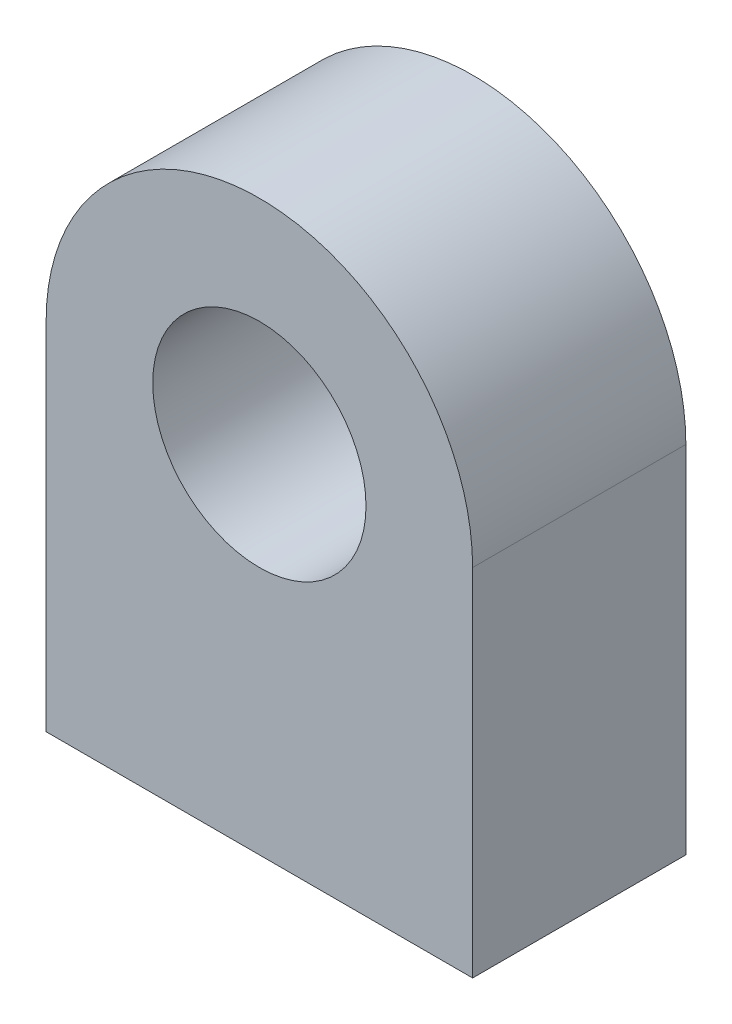
ISO-10303-21;
HEADER;
FILE_DESCRIPTION(('STEP AP214'),'2;1');
FILE_NAME('part.step','',(''),(''),'','','');
FILE_SCHEMA(('AUTOMOTIVE_DESIGN { 1 0 10303 214 1 1 1 1 }'));
ENDSEC;
DATA;
#1=APPLICATION_CONTEXT('core data for automotive mechanical design processes');
#2=APPLICATION_PROTOCOL_DEFINITION('international standard','automotive_design',2000,#1);
#3=PRODUCT_CONTEXT('',#1,'mechanical');
#4=PRODUCT('Part','Part','',(#3));
#5=PRODUCT_RELATED_PRODUCT_CATEGORY('part','',(#4));
#6=PRODUCT_DEFINITION_FORMATION('','',#4);
#7=PRODUCT_DEFINITION_CONTEXT('part definition',#1,'design');
#8=PRODUCT_DEFINITION('design','',#6,#7);
#9=PRODUCT_DEFINITION_SHAPE('','',#8);
#10=(LENGTH_UNIT() NAMED_UNIT(*) SI_UNIT(.MILLI.,.METRE.));
#11=(NAMED_UNIT(*) PLANE_ANGLE_UNIT() SI_UNIT($,.RADIAN.));
#12=(NAMED_UNIT(*) SI_UNIT($,.STERADIAN.) SOLID_ANGLE_UNIT());
#13=UNCERTAINTY_MEASURE_WITH_UNIT(LENGTH_MEASURE(1.E-05),#10,'distance_accuracy_value','');
#14=(GEOMETRIC_REPRESENTATION_CONTEXT(3) GLOBAL_UNCERTAINTY_ASSIGNED_CONTEXT((#13)) GLOBAL_UNIT_ASSIGNED_CONTEXT((#10,
#11,#12)) REPRESENTATION_CONTEXT('',''));
#15=CARTESIAN_POINT('',(0.,0.,0.));
#16=DIRECTION('',(0.,0.,1.));
#17=DIRECTION('',(1.,0.,0.));
#18=AXIS2_PLACEMENT_3D('',#15,#16,#17);
#19=CARTESIAN_POINT('',(0.,-1.69336380175111,4.8387));
#20=DIRECTION('',(0.,0.,1.));
#21=DIRECTION('',(1.,0.,0.));
#22=AXIS2_PLACEMENT_3D('',#19,#20,#21);
#23=PLANE('',#22);
#24=DIRECTION('',(0.,1.,0.));
#25=VECTOR('',#24,1.);
#26=CARTESIAN_POINT('',(-9.67740000000001,-12.90447,4.8387));
#27=LINE('',#26,#25);
#28=CARTESIAN_POINT('',(-9.67740000000001,-12.90447,4.8387));
#29=VERTEX_POINT('',#28);
#30=CARTESIAN_POINT('',(-9.6774,3.22707000000001,4.8387));
#31=VERTEX_POINT('',#30);
#32=EDGE_CURVE('E51',#29,#31,#27,.T.);
#33=ORIENTED_EDGE('',*,*,#32,.F.);
#34=DIRECTION('',(1.,0.,0.));
#35=VECTOR('',#34,1.);
#36=CARTESIAN_POINT('',(9.67740000000001,-12.90447,4.8387));
#37=LINE('',#36,#35);
#38=CARTESIAN_POINT('',(9.67740000000001,-12.90447,4.8387));
#39=VERTEX_POINT('',#38);
#40=EDGE_CURVE('E68',#39,#29,#37,.F.);
#41=ORIENTED_EDGE('',*,*,#40,.F.);
#42=DIRECTION('',(0.,1.,0.));
#43=VECTOR('',#42,1.);
#44=CARTESIAN_POINT('',(9.67740000000001,3.22707000000001,4.8387));
#45=LINE('',#44,#43);
#46=CARTESIAN_POINT('',(9.6774,3.22707000000001,4.8387));
#47=VERTEX_POINT('',#46);
#48=EDGE_CURVE('E56',#47,#39,#45,.F.);
#49=ORIENTED_EDGE('',*,*,#48,.F.);
#50=CARTESIAN_POINT('',(0.,3.22707000000001,4.8387));
#51=DIRECTION('',(0.,0.,1.));
#52=DIRECTION('',(1.,0.,0.));
#53=AXIS2_PLACEMENT_3D('',#50,#51,#52);
#54=CIRCLE('',#53,9.6774);
#55=EDGE_CURVE('E91',#31,#47,#54,.F.);
#56=ORIENTED_EDGE('',*,*,#55,.F.);
#57=EDGE_LOOP('',(#33,#41,#49,#56));
#58=FACE_BOUND('',#57,.T.);
#59=CARTESIAN_POINT('',(0.,3.22707000000001,4.8387));
#60=DIRECTION('',(0.,0.,1.));
#61=DIRECTION('',(1.,0.,0.));
#62=AXIS2_PLACEMENT_3D('',#59,#60,#61);
#63=CIRCLE('',#62,4.8387);
#64=CARTESIAN_POINT('',(4.8387,3.22707000000001,4.8387));
#65=VERTEX_POINT('',#64);
#66=EDGE_CURVE('E19',#65,#65,#63,.F.);
#67=ORIENTED_EDGE('',*,*,#66,.T.);
#68=EDGE_LOOP('',(#67));
#69=FACE_BOUND('',#68,.T.);
#70=ADVANCED_FACE('F16',(#58,#69),#23,.T.);
#71=CARTESIAN_POINT('',(0.,3.22707000000001,-4.8387));
#72=DIRECTION('',(0.,0.,1.));
#73=DIRECTION('',(1.,0.,0.));
#74=AXIS2_PLACEMENT_3D('',#71,#72,#73);
#75=CYLINDRICAL_SURFACE('',#74,4.8387);
#76=ORIENTED_EDGE('',*,*,#66,.F.);
#77=EDGE_LOOP('',(#76));
#78=FACE_BOUND('',#77,.T.);
#79=CARTESIAN_POINT('',(0.,3.22707000000001,-4.8387));
#80=DIRECTION('',(0.,0.,1.));
#81=DIRECTION('',(1.,0.,0.));
#82=AXIS2_PLACEMENT_3D('',#79,#80,#81);
#83=CIRCLE('',#82,4.8387);
#84=CARTESIAN_POINT('',(4.8387,3.22707000000001,-4.8387));
#85=VERTEX_POINT('',#84);
#86=EDGE_CURVE('E80',#85,#85,#83,.F.);
#87=ORIENTED_EDGE('',*,*,#86,.T.);
#88=EDGE_LOOP('',(#87));
#89=FACE_BOUND('',#88,.T.);
#90=ADVANCED_FACE('F155',(#78,#89),#75,.F.);
#91=CARTESIAN_POINT('',(-9.67740000000001,-12.90447,-4.8387));
#92=DIRECTION('',(-1.,0.,0.));
#93=DIRECTION('',(0.,0.,1.));
#94=AXIS2_PLACEMENT_3D('',#91,#92,#93);
#95=PLANE('',#94);
#96=DIRECTION('',(0.,1.,0.));
#97=VECTOR('',#96,1.);
#98=CARTESIAN_POINT('',(-9.67740000000001,-1.69336380175111,-4.8387));
#99=LINE('',#98,#97);
#100=CARTESIAN_POINT('',(-9.6774,3.22707000000001,-4.8387));
#101=VERTEX_POINT('',#100);
#102=CARTESIAN_POINT('',(-9.67740000000001,-12.90447,-4.8387));
#103=VERTEX_POINT('',#102);
#104=EDGE_CURVE('E75',#101,#103,#99,.F.);
#105=ORIENTED_EDGE('',*,*,#104,.T.);
#106=DIRECTION('',(0.,0.,-1.));
#107=VECTOR('',#106,1.);
#108=CARTESIAN_POINT('',(-9.67740000000001,-12.90447,-4.8387));
#109=LINE('',#108,#107);
#110=EDGE_CURVE('E63',#29,#103,#109,.T.);
#111=ORIENTED_EDGE('',*,*,#110,.F.);
#112=ORIENTED_EDGE('',*,*,#32,.T.);
#113=DIRECTION('',(0.,0.,1.));
#114=VECTOR('',#113,1.);
#115=CARTESIAN_POINT('',(-9.6774,3.22707000000001,-4.8387));
#116=LINE('',#115,#114);
#117=EDGE_CURVE('E79',#101,#31,#116,.T.);
#118=ORIENTED_EDGE('',*,*,#117,.F.);
#119=EDGE_LOOP('',(#105,#111,#112,#118));
#120=FACE_BOUND('',#119,.T.);
#121=ADVANCED_FACE('F78',(#120),#95,.T.);
#122=CARTESIAN_POINT('',(9.67740000000001,-12.90447,-4.8387));
#123=DIRECTION('',(0.,-1.,0.));
#124=DIRECTION('',(0.,0.,-1.));
#125=AXIS2_PLACEMENT_3D('',#122,#123,#124);
#126=PLANE('',#125);
#127=DIRECTION('',(1.,0.,0.));
#128=VECTOR('',#127,1.);
#129=CARTESIAN_POINT('',(0.,-12.90447,-4.8387));
#130=LINE('',#129,#128);
#131=CARTESIAN_POINT('',(9.67740000000001,-12.90447,-4.8387));
#132=VERTEX_POINT('',#131);
#133=EDGE_CURVE('E67',#103,#132,#130,.T.);
#134=ORIENTED_EDGE('',*,*,#133,.T.);
#135=DIRECTION('',(0.,0.,-1.));
#136=VECTOR('',#135,1.);
#137=CARTESIAN_POINT('',(9.67740000000001,-12.90447,-4.8387));
#138=LINE('',#137,#136);
#139=EDGE_CURVE('E93',#39,#132,#138,.T.);
#140=ORIENTED_EDGE('',*,*,#139,.F.);
#141=ORIENTED_EDGE('',*,*,#40,.T.);
#142=ORIENTED_EDGE('',*,*,#110,.T.);
#143=EDGE_LOOP('',(#134,#140,#141,#142));
#144=FACE_BOUND('',#143,.T.);
#145=ADVANCED_FACE('F65',(#144),#126,.T.);
#146=CARTESIAN_POINT('',(9.67740000000001,3.22707000000001,-4.8387));
#147=DIRECTION('',(1.,0.,0.));
#148=DIRECTION('',(0.,0.,-1.));
#149=AXIS2_PLACEMENT_3D('',#146,#147,#148);
#150=PLANE('',#149);
#151=DIRECTION('',(0.,1.,0.));
#152=VECTOR('',#151,1.);
#153=CARTESIAN_POINT('',(9.67740000000001,-1.69336380175111,-4.8387));
#154=LINE('',#153,#152);
#155=CARTESIAN_POINT('',(9.6774,3.22707000000001,-4.8387));
#156=VERTEX_POINT('',#155);
#157=EDGE_CURVE('E25',#132,#156,#154,.T.);
#158=ORIENTED_EDGE('',*,*,#157,.T.);
#159=DIRECTION('',(0.,0.,1.));
#160=VECTOR('',#159,1.);
#161=CARTESIAN_POINT('',(9.6774,3.22707000000001,-4.8387));
#162=LINE('',#161,#160);
#163=EDGE_CURVE('E33',#47,#156,#162,.F.);
#164=ORIENTED_EDGE('',*,*,#163,.F.);
#165=ORIENTED_EDGE('',*,*,#48,.T.);
#166=ORIENTED_EDGE('',*,*,#139,.T.);
#167=EDGE_LOOP('',(#158,#164,#165,#166));
#168=FACE_BOUND('',#167,.T.);
#169=ADVANCED_FACE('F113',(#168),#150,.T.);
#170=CARTESIAN_POINT('',(0.,3.22707000000001,-4.8387));
#171=DIRECTION('',(0.,0.,1.));
#172=DIRECTION('',(1.,0.,0.));
#173=AXIS2_PLACEMENT_3D('',#170,#171,#172);
#174=CYLINDRICAL_SURFACE('',#173,9.6774);
#175=CARTESIAN_POINT('',(0.,3.22707000000001,-4.8387));
#176=DIRECTION('',(0.,0.,1.));
#177=DIRECTION('',(1.,0.,0.));
#178=AXIS2_PLACEMENT_3D('',#175,#176,#177);
#179=CIRCLE('',#178,9.6774);
#180=EDGE_CURVE('E11',#156,#101,#179,.T.);
#181=ORIENTED_EDGE('',*,*,#180,.T.);
#182=ORIENTED_EDGE('',*,*,#117,.T.);
#183=ORIENTED_EDGE('',*,*,#55,.T.);
#184=ORIENTED_EDGE('',*,*,#163,.T.);
#185=EDGE_LOOP('',(#181,#182,#183,#184));
#186=FACE_BOUND('',#185,.T.);
#187=ADVANCED_FACE('F110',(#186),#174,.T.);
#188=CARTESIAN_POINT('',(0.,-1.69336380175111,-4.8387));
#189=DIRECTION('',(0.,0.,1.));
#190=DIRECTION('',(1.,0.,0.));
#191=AXIS2_PLACEMENT_3D('',#188,#189,#190);
#192=PLANE('',#191);
#193=ORIENTED_EDGE('',*,*,#157,.F.);
#194=ORIENTED_EDGE('',*,*,#133,.F.);
#195=ORIENTED_EDGE('',*,*,#104,.F.);
#196=ORIENTED_EDGE('',*,*,#180,.F.);
#197=EDGE_LOOP('',(#193,#194,#195,#196));
#198=FACE_BOUND('',#197,.T.);
#199=ORIENTED_EDGE('',*,*,#86,.F.);
#200=EDGE_LOOP('',(#199));
#201=FACE_BOUND('',#200,.T.);
#202=ADVANCED_FACE('F73',(#198,#201),#192,.F.);
#203=CLOSED_SHELL('',(#70,#90,#121,#145,#169,#187,#202));
#204=MANIFOLD_SOLID_BREP('B1',#203);
#205=ADVANCED_BREP_SHAPE_REPRESENTATION('',(#18,#204),#14);
#206=SHAPE_DEFINITION_REPRESENTATION(#9,#205);
ENDSEC;
END-ISO-10303-21;
